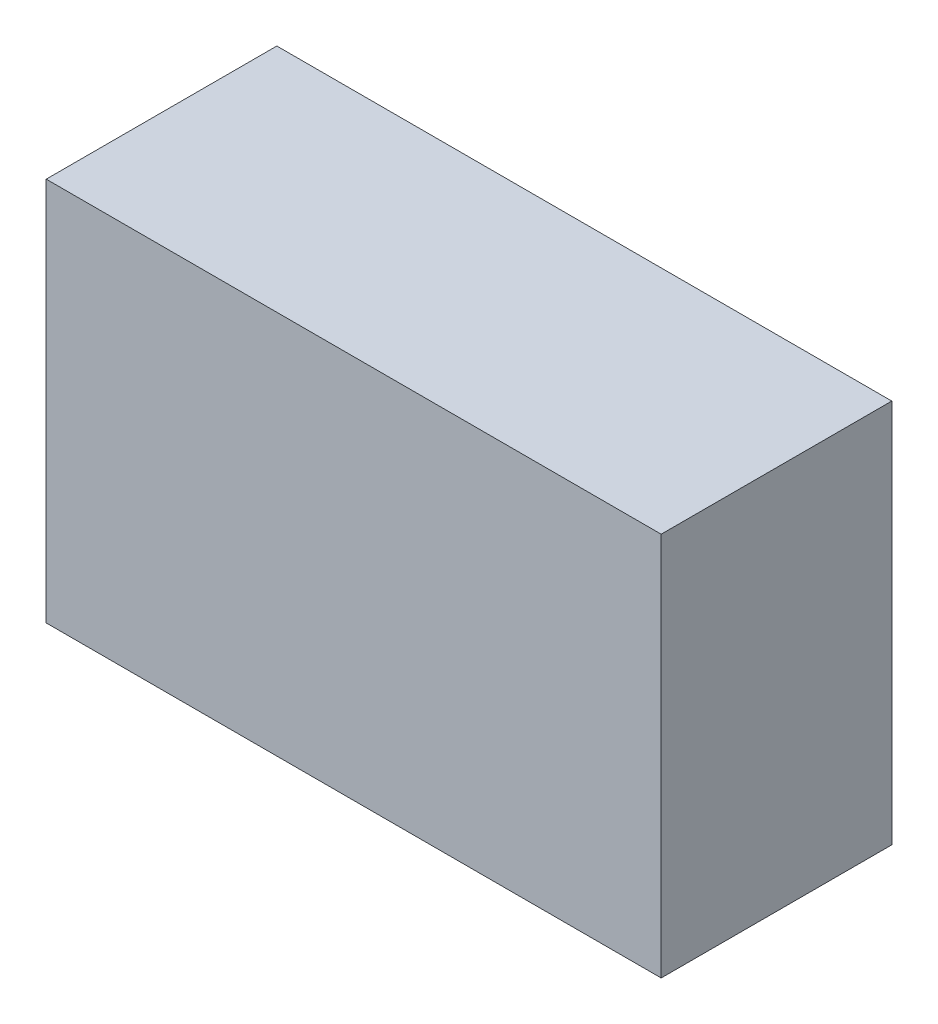
ISO-10303-21;
HEADER;
FILE_DESCRIPTION(('STEP AP214'),'2;1');
FILE_NAME('part.step','',(''),(''),'','','');
FILE_SCHEMA(('AUTOMOTIVE_DESIGN { 1 0 10303 214 1 1 1 1 }'));
ENDSEC;
DATA;
#1=APPLICATION_CONTEXT('core data for automotive mechanical design processes');
#2=APPLICATION_PROTOCOL_DEFINITION('international standard','automotive_design',2000,#1);
#3=PRODUCT_CONTEXT('',#1,'mechanical');
#4=PRODUCT('Part','Part','',(#3));
#5=PRODUCT_RELATED_PRODUCT_CATEGORY('part','',(#4));
#6=PRODUCT_DEFINITION_FORMATION('','',#4);
#7=PRODUCT_DEFINITION_CONTEXT('part definition',#1,'design');
#8=PRODUCT_DEFINITION('design','',#6,#7);
#9=PRODUCT_DEFINITION_SHAPE('','',#8);
#10=(LENGTH_UNIT() NAMED_UNIT(*) SI_UNIT(.MILLI.,.METRE.));
#11=(NAMED_UNIT(*) PLANE_ANGLE_UNIT() SI_UNIT($,.RADIAN.));
#12=(NAMED_UNIT(*) SI_UNIT($,.STERADIAN.) SOLID_ANGLE_UNIT());
#13=UNCERTAINTY_MEASURE_WITH_UNIT(LENGTH_MEASURE(1.E-05),#10,'distance_accuracy_value','');
#14=(GEOMETRIC_REPRESENTATION_CONTEXT(3) GLOBAL_UNCERTAINTY_ASSIGNED_CONTEXT((#13)) GLOBAL_UNIT_ASSIGNED_CONTEXT((#10,
#11,#12)) REPRESENTATION_CONTEXT('',''));
#15=CARTESIAN_POINT('',(0.,0.,0.));
#16=DIRECTION('',(0.,0.,1.));
#17=DIRECTION('',(1.,0.,0.));
#18=AXIS2_PLACEMENT_3D('',#15,#16,#17);
#19=CARTESIAN_POINT('',(-9050.,-300.,1500.));
#20=DIRECTION('',(1.,0.,0.));
#21=DIRECTION('',(0.,0.,-1.));
#22=AXIS2_PLACEMENT_3D('',#19,#20,#21);
#23=PLANE('',#22);
#24=DIRECTION('',(0.,-1.,0.));
#25=VECTOR('',#24,1.);
#26=CARTESIAN_POINT('',(-9050.,-300.,0.));
#27=LINE('',#26,#25);
#28=CARTESIAN_POINT('',(-9050.,-300.,0.));
#29=VERTEX_POINT('',#28);
#30=CARTESIAN_POINT('',(-9050.,-2800.,0.));
#31=VERTEX_POINT('',#30);
#32=EDGE_CURVE('E93',#29,#31,#27,.T.);
#33=ORIENTED_EDGE('',*,*,#32,.T.);
#34=DIRECTION('',(0.,0.,-1.));
#35=VECTOR('',#34,1.);
#36=CARTESIAN_POINT('',(-9050.,-2800.,1500.));
#37=LINE('',#36,#35);
#38=CARTESIAN_POINT('',(-9050.,-2800.,1500.));
#39=VERTEX_POINT('',#38);
#40=EDGE_CURVE('E11',#39,#31,#37,.T.);
#41=ORIENTED_EDGE('',*,*,#40,.F.);
#42=DIRECTION('',(0.,-1.,0.));
#43=VECTOR('',#42,1.);
#44=CARTESIAN_POINT('',(-9050.,-300.,1500.));
#45=LINE('',#44,#43);
#46=CARTESIAN_POINT('',(-9050.,-300.,1500.));
#47=VERTEX_POINT('',#46);
#48=EDGE_CURVE('E81',#47,#39,#45,.T.);
#49=ORIENTED_EDGE('',*,*,#48,.F.);
#50=DIRECTION('',(0.,0.,-1.));
#51=VECTOR('',#50,1.);
#52=CARTESIAN_POINT('',(-9050.,-300.,1500.));
#53=LINE('',#52,#51);
#54=EDGE_CURVE('E89',#47,#29,#53,.T.);
#55=ORIENTED_EDGE('',*,*,#54,.T.);
#56=EDGE_LOOP('',(#33,#41,#49,#55));
#57=FACE_BOUND('',#56,.T.);
#58=ADVANCED_FACE('F30',(#57),#23,.F.);
#59=CARTESIAN_POINT('',(-9050.,-2800.,1500.));
#60=DIRECTION('',(0.,1.,0.));
#61=DIRECTION('',(0.,0.,1.));
#62=AXIS2_PLACEMENT_3D('',#59,#60,#61);
#63=PLANE('',#62);
#64=DIRECTION('',(1.,0.,0.));
#65=VECTOR('',#64,1.);
#66=CARTESIAN_POINT('',(-9050.,-2800.,0.));
#67=LINE('',#66,#65);
#68=CARTESIAN_POINT('',(-5050.,-2800.,0.));
#69=VERTEX_POINT('',#68);
#70=EDGE_CURVE('E85',#31,#69,#67,.T.);
#71=ORIENTED_EDGE('',*,*,#70,.T.);
#72=DIRECTION('',(0.,0.,-1.));
#73=VECTOR('',#72,1.);
#74=CARTESIAN_POINT('',(-5050.,-2800.,1500.));
#75=LINE('',#74,#73);
#76=CARTESIAN_POINT('',(-5050.,-2800.,1500.));
#77=VERTEX_POINT('',#76);
#78=EDGE_CURVE('E38',#77,#69,#75,.T.);
#79=ORIENTED_EDGE('',*,*,#78,.F.);
#80=DIRECTION('',(1.,0.,0.));
#81=VECTOR('',#80,1.);
#82=CARTESIAN_POINT('',(-9050.,-2800.,1500.));
#83=LINE('',#82,#81);
#84=EDGE_CURVE('E76',#39,#77,#83,.T.);
#85=ORIENTED_EDGE('',*,*,#84,.F.);
#86=ORIENTED_EDGE('',*,*,#40,.T.);
#87=EDGE_LOOP('',(#71,#79,#85,#86));
#88=FACE_BOUND('',#87,.T.);
#89=ADVANCED_FACE('F84',(#88),#63,.F.);
#90=CARTESIAN_POINT('',(-5050.,-300.,1500.));
#91=DIRECTION('',(-1.,0.,0.));
#92=DIRECTION('',(0.,-1.,0.));
#93=AXIS2_PLACEMENT_3D('',#90,#91,#92);
#94=PLANE('',#93);
#95=DIRECTION('',(0.,1.,0.));
#96=VECTOR('',#95,1.);
#97=CARTESIAN_POINT('',(-5050.,-300.,0.));
#98=LINE('',#97,#96);
#99=CARTESIAN_POINT('',(-5050.,-300.,0.));
#100=VERTEX_POINT('',#99);
#101=EDGE_CURVE('E63',#69,#100,#98,.T.);
#102=ORIENTED_EDGE('',*,*,#101,.T.);
#103=DIRECTION('',(0.,0.,-1.));
#104=VECTOR('',#103,1.);
#105=CARTESIAN_POINT('',(-5050.,-300.,1500.));
#106=LINE('',#105,#104);
#107=CARTESIAN_POINT('',(-5050.,-300.,1500.));
#108=VERTEX_POINT('',#107);
#109=EDGE_CURVE('E86',#108,#100,#106,.T.);
#110=ORIENTED_EDGE('',*,*,#109,.F.);
#111=DIRECTION('',(0.,1.,0.));
#112=VECTOR('',#111,1.);
#113=CARTESIAN_POINT('',(-5050.,-300.,1500.));
#114=LINE('',#113,#112);
#115=EDGE_CURVE('E79',#77,#108,#114,.T.);
#116=ORIENTED_EDGE('',*,*,#115,.F.);
#117=ORIENTED_EDGE('',*,*,#78,.T.);
#118=EDGE_LOOP('',(#102,#110,#116,#117));
#119=FACE_BOUND('',#118,.T.);
#120=ADVANCED_FACE('F87',(#119),#94,.F.);
#121=CARTESIAN_POINT('',(-9050.,-300.,1500.));
#122=DIRECTION('',(0.,-1.,0.));
#123=DIRECTION('',(0.,0.,-1.));
#124=AXIS2_PLACEMENT_3D('',#121,#122,#123);
#125=PLANE('',#124);
#126=DIRECTION('',(-1.,0.,0.));
#127=VECTOR('',#126,1.);
#128=CARTESIAN_POINT('',(-9050.,-300.,0.));
#129=LINE('',#128,#127);
#130=EDGE_CURVE('E69',#100,#29,#129,.T.);
#131=ORIENTED_EDGE('',*,*,#130,.T.);
#132=ORIENTED_EDGE('',*,*,#54,.F.);
#133=DIRECTION('',(-1.,0.,0.));
#134=VECTOR('',#133,1.);
#135=CARTESIAN_POINT('',(-9050.,-300.,1500.));
#136=LINE('',#135,#134);
#137=EDGE_CURVE('E46',#108,#47,#136,.T.);
#138=ORIENTED_EDGE('',*,*,#137,.F.);
#139=ORIENTED_EDGE('',*,*,#109,.T.);
#140=EDGE_LOOP('',(#131,#132,#138,#139));
#141=FACE_BOUND('',#140,.T.);
#142=ADVANCED_FACE('F100',(#141),#125,.F.);
#143=CARTESIAN_POINT('',(-9050.,-2800.,1500.));
#144=DIRECTION('',(0.,0.,1.));
#145=DIRECTION('',(1.,0.,0.));
#146=AXIS2_PLACEMENT_3D('',#143,#144,#145);
#147=PLANE('',#146);
#148=ORIENTED_EDGE('',*,*,#48,.T.);
#149=ORIENTED_EDGE('',*,*,#84,.T.);
#150=ORIENTED_EDGE('',*,*,#115,.T.);
#151=ORIENTED_EDGE('',*,*,#137,.T.);
#152=EDGE_LOOP('',(#148,#149,#150,#151));
#153=FACE_BOUND('',#152,.T.);
#154=ADVANCED_FACE('F77',(#153),#147,.T.);
#155=CARTESIAN_POINT('',(-9050.,-2800.,0.));
#156=DIRECTION('',(0.,0.,1.));
#157=DIRECTION('',(1.,0.,0.));
#158=AXIS2_PLACEMENT_3D('',#155,#156,#157);
#159=PLANE('',#158);
#160=ORIENTED_EDGE('',*,*,#32,.F.);
#161=ORIENTED_EDGE('',*,*,#130,.F.);
#162=ORIENTED_EDGE('',*,*,#101,.F.);
#163=ORIENTED_EDGE('',*,*,#70,.F.);
#164=EDGE_LOOP('',(#160,#161,#162,#163));
#165=FACE_BOUND('',#164,.T.);
#166=ADVANCED_FACE('F103',(#165),#159,.F.);
#167=CLOSED_SHELL('',(#58,#89,#120,#142,#154,#166));
#168=MANIFOLD_SOLID_BREP('B2',#167);
#169=ADVANCED_BREP_SHAPE_REPRESENTATION('',(#18,#168),#14);
#170=SHAPE_DEFINITION_REPRESENTATION(#9,#169);
ENDSEC;
END-ISO-10303-21;
